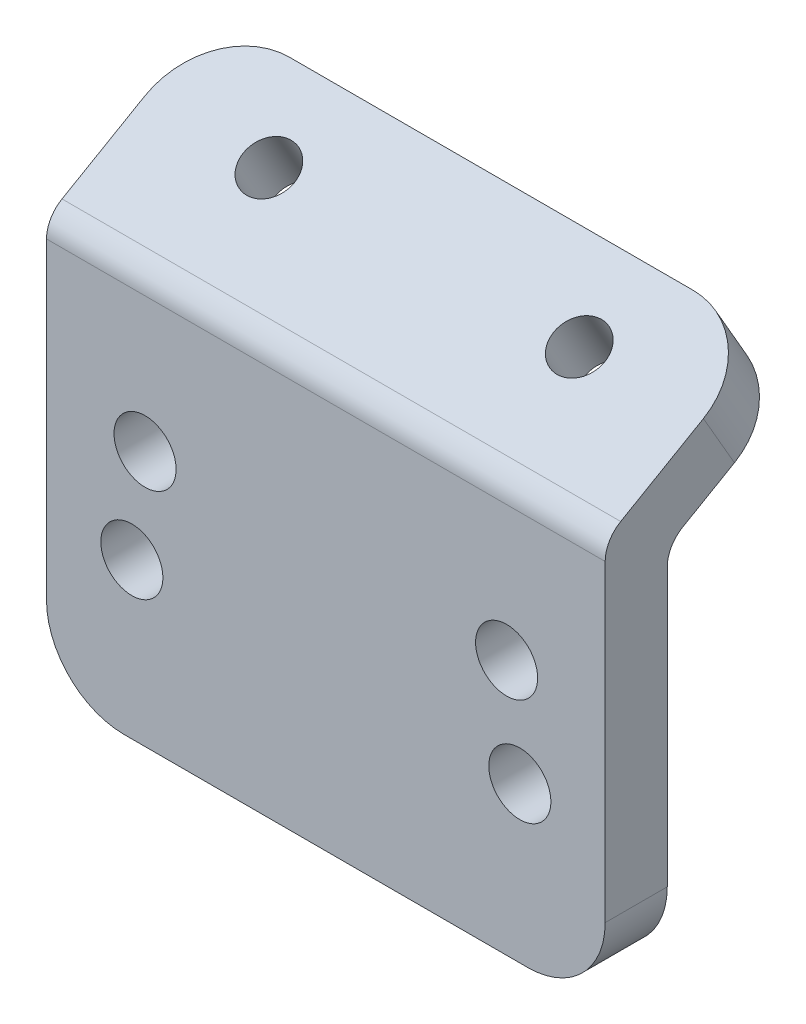
ISO-10303-21;
HEADER;
FILE_DESCRIPTION(('STEP AP214'),'2;1');
FILE_NAME('part.step','',(''),(''),'','','');
FILE_SCHEMA(('AUTOMOTIVE_DESIGN { 1 0 10303 214 1 1 1 1 }'));
ENDSEC;
DATA;
#1=APPLICATION_CONTEXT('core data for automotive mechanical design processes');
#2=APPLICATION_PROTOCOL_DEFINITION('international standard','automotive_design',2000,#1);
#3=PRODUCT_CONTEXT('',#1,'mechanical');
#4=PRODUCT('Part','Part','',(#3));
#5=PRODUCT_RELATED_PRODUCT_CATEGORY('part','',(#4));
#6=PRODUCT_DEFINITION_FORMATION('','',#4);
#7=PRODUCT_DEFINITION_CONTEXT('part definition',#1,'design');
#8=PRODUCT_DEFINITION('design','',#6,#7);
#9=PRODUCT_DEFINITION_SHAPE('','',#8);
#10=(LENGTH_UNIT() NAMED_UNIT(*) SI_UNIT(.MILLI.,.METRE.));
#11=(NAMED_UNIT(*) PLANE_ANGLE_UNIT() SI_UNIT($,.RADIAN.));
#12=(NAMED_UNIT(*) SI_UNIT($,.STERADIAN.) SOLID_ANGLE_UNIT());
#13=UNCERTAINTY_MEASURE_WITH_UNIT(LENGTH_MEASURE(1.E-05),#10,'distance_accuracy_value','');
#14=(GEOMETRIC_REPRESENTATION_CONTEXT(3) GLOBAL_UNCERTAINTY_ASSIGNED_CONTEXT((#13)) GLOBAL_UNIT_ASSIGNED_CONTEXT((#10,
#11,#12)) REPRESENTATION_CONTEXT('',''));
#15=CARTESIAN_POINT('',(0.,0.,0.));
#16=DIRECTION('',(0.,0.,1.));
#17=DIRECTION('',(1.,0.,0.));
#18=AXIS2_PLACEMENT_3D('',#15,#16,#17);
#19=CARTESIAN_POINT('',(0.,0.,4.));
#20=DIRECTION('',(1.,0.,0.));
#21=DIRECTION('',(0.,0.,-1.));
#22=AXIS2_PLACEMENT_3D('',#19,#20,#21);
#23=PLANE('',#22);
#24=DIRECTION('',(0.,-1.,0.));
#25=VECTOR('',#24,1.);
#26=CARTESIAN_POINT('',(0.,0.,4.));
#27=LINE('',#26,#25);
#28=CARTESIAN_POINT('',(0.,25.1547005383793,4.));
#29=VERTEX_POINT('',#28);
#30=CARTESIAN_POINT('',(0.,5.,4.));
#31=VERTEX_POINT('',#30);
#32=EDGE_CURVE('E250',#29,#31,#27,.T.);
#33=ORIENTED_EDGE('',*,*,#32,.F.);
#34=CARTESIAN_POINT('',(0.,25.1547005383793,2.));
#35=DIRECTION('',(1.,0.,0.));
#36=DIRECTION('',(0.,0.,-1.));
#37=AXIS2_PLACEMENT_3D('',#34,#35,#36);
#38=CIRCLE('',#37,2.);
#39=CARTESIAN_POINT('',(0.,26.8867513459481,2.99999999999999));
#40=VERTEX_POINT('',#39);
#41=EDGE_CURVE('E194',#29,#40,#38,.F.);
#42=ORIENTED_EDGE('',*,*,#41,.T.);
#43=DIRECTION('',(0.,-0.499999999999998,0.86602540378444));
#44=VECTOR('',#43,1.);
#45=CARTESIAN_POINT('',(0.,32.4641016151377,-6.66025403784441));
#46=LINE('',#45,#44);
#47=CARTESIAN_POINT('',(0.,29.9641016151378,-2.33012701892221));
#48=VERTEX_POINT('',#47);
#49=EDGE_CURVE('E148',#48,#40,#46,.T.);
#50=ORIENTED_EDGE('',*,*,#49,.F.);
#51=DIRECTION('',(0.,0.86602540378444,0.499999999999998));
#52=VECTOR('',#51,1.);
#53=CARTESIAN_POINT('',(0.,26.5,-4.3301270189222));
#54=LINE('',#53,#52);
#55=CARTESIAN_POINT('',(0.,26.5,-4.3301270189222));
#56=VERTEX_POINT('',#55);
#57=EDGE_CURVE('E163',#48,#56,#54,.F.);
#58=ORIENTED_EDGE('',*,*,#57,.T.);
#59=DIRECTION('',(0.,0.499999999999998,-0.866025403784439));
#60=VECTOR('',#59,1.);
#61=CARTESIAN_POINT('',(0.,24.,0.));
#62=LINE('',#61,#60);
#63=CARTESIAN_POINT('',(0.,24.5773502691896,-1.));
#64=VERTEX_POINT('',#63);
#65=EDGE_CURVE('E131',#64,#56,#62,.T.);
#66=ORIENTED_EDGE('',*,*,#65,.F.);
#67=CARTESIAN_POINT('',(0.,22.8452994616207,-2.));
#68=DIRECTION('',(1.,0.,0.));
#69=DIRECTION('',(0.,0.,-1.));
#70=AXIS2_PLACEMENT_3D('',#67,#68,#69);
#71=CIRCLE('',#70,2.);
#72=CARTESIAN_POINT('',(0.,22.8452994616207,0.));
#73=VERTEX_POINT('',#72);
#74=EDGE_CURVE('E41',#64,#73,#71,.T.);
#75=ORIENTED_EDGE('',*,*,#74,.T.);
#76=DIRECTION('',(0.,-1.,0.));
#77=VECTOR('',#76,1.);
#78=CARTESIAN_POINT('',(0.,0.,0.));
#79=LINE('',#78,#77);
#80=CARTESIAN_POINT('',(0.,5.,0.));
#81=VERTEX_POINT('',#80);
#82=EDGE_CURVE('E197',#73,#81,#79,.T.);
#83=ORIENTED_EDGE('',*,*,#82,.T.);
#84=DIRECTION('',(0.,0.,-1.));
#85=VECTOR('',#84,1.);
#86=CARTESIAN_POINT('',(0.,5.,4.));
#87=LINE('',#86,#85);
#88=EDGE_CURVE('E160',#81,#31,#87,.F.);
#89=ORIENTED_EDGE('',*,*,#88,.T.);
#90=EDGE_LOOP('',(#33,#42,#50,#58,#66,#75,#83,#89));
#91=FACE_BOUND('',#90,.T.);
#92=ADVANCED_FACE('F33',(#91),#23,.F.);
#93=CARTESIAN_POINT('',(0.,0.,4.));
#94=DIRECTION('',(0.,1.,0.));
#95=DIRECTION('',(0.,0.,1.));
#96=AXIS2_PLACEMENT_3D('',#93,#94,#95);
#97=PLANE('',#96);
#98=DIRECTION('',(1.,0.,0.));
#99=VECTOR('',#98,1.);
#100=CARTESIAN_POINT('',(0.,0.,4.));
#101=LINE('',#100,#99);
#102=CARTESIAN_POINT('',(5.,0.,4.));
#103=VERTEX_POINT('',#102);
#104=CARTESIAN_POINT('',(31.,0.,4.));
#105=VERTEX_POINT('',#104);
#106=EDGE_CURVE('E252',#103,#105,#101,.T.);
#107=ORIENTED_EDGE('',*,*,#106,.F.);
#108=DIRECTION('',(0.,0.,-1.));
#109=VECTOR('',#108,1.);
#110=CARTESIAN_POINT('',(5.,0.,4.));
#111=LINE('',#110,#109);
#112=CARTESIAN_POINT('',(5.,0.,0.));
#113=VERTEX_POINT('',#112);
#114=EDGE_CURVE('E173',#103,#113,#111,.T.);
#115=ORIENTED_EDGE('',*,*,#114,.T.);
#116=DIRECTION('',(1.,0.,0.));
#117=VECTOR('',#116,1.);
#118=CARTESIAN_POINT('',(0.,0.,0.));
#119=LINE('',#118,#117);
#120=CARTESIAN_POINT('',(31.,0.,0.));
#121=VERTEX_POINT('',#120);
#122=EDGE_CURVE('E207',#113,#121,#119,.T.);
#123=ORIENTED_EDGE('',*,*,#122,.T.);
#124=DIRECTION('',(0.,0.,-1.));
#125=VECTOR('',#124,1.);
#126=CARTESIAN_POINT('',(31.,0.,4.));
#127=LINE('',#126,#125);
#128=EDGE_CURVE('E171',#121,#105,#127,.F.);
#129=ORIENTED_EDGE('',*,*,#128,.T.);
#130=EDGE_LOOP('',(#107,#115,#123,#129));
#131=FACE_BOUND('',#130,.T.);
#132=ADVANCED_FACE('F284',(#131),#97,.F.);
#133=CARTESIAN_POINT('',(36.,0.,4.));
#134=DIRECTION('',(-1.,0.,0.));
#135=DIRECTION('',(0.,0.,1.));
#136=AXIS2_PLACEMENT_3D('',#133,#134,#135);
#137=PLANE('',#136);
#138=DIRECTION('',(0.,-0.499999999999998,0.86602540378444));
#139=VECTOR('',#138,1.);
#140=CARTESIAN_POINT('',(36.,32.4641016151377,-6.66025403784441));
#141=LINE('',#140,#139);
#142=CARTESIAN_POINT('',(36.,29.9641016151378,-2.33012701892221));
#143=VERTEX_POINT('',#142);
#144=CARTESIAN_POINT('',(36.,26.8867513459481,2.99999999999999));
#145=VERTEX_POINT('',#144);
#146=EDGE_CURVE('E216',#143,#145,#141,.T.);
#147=ORIENTED_EDGE('',*,*,#146,.T.);
#148=CARTESIAN_POINT('',(36.,25.1547005383793,2.));
#149=DIRECTION('',(-1.,0.,0.));
#150=DIRECTION('',(0.,0.,1.));
#151=AXIS2_PLACEMENT_3D('',#148,#149,#150);
#152=CIRCLE('',#151,2.);
#153=CARTESIAN_POINT('',(36.,25.1547005383793,4.));
#154=VERTEX_POINT('',#153);
#155=EDGE_CURVE('E56',#145,#154,#152,.F.);
#156=ORIENTED_EDGE('',*,*,#155,.T.);
#157=DIRECTION('',(0.,1.,0.));
#158=VECTOR('',#157,1.);
#159=CARTESIAN_POINT('',(36.,0.,4.));
#160=LINE('',#159,#158);
#161=CARTESIAN_POINT('',(36.,5.,4.));
#162=VERTEX_POINT('',#161);
#163=EDGE_CURVE('E155',#162,#154,#160,.T.);
#164=ORIENTED_EDGE('',*,*,#163,.F.);
#165=DIRECTION('',(0.,0.,-1.));
#166=VECTOR('',#165,1.);
#167=CARTESIAN_POINT('',(36.,5.,4.));
#168=LINE('',#167,#166);
#169=CARTESIAN_POINT('',(36.,5.,0.));
#170=VERTEX_POINT('',#169);
#171=EDGE_CURVE('E136',#162,#170,#168,.T.);
#172=ORIENTED_EDGE('',*,*,#171,.T.);
#173=DIRECTION('',(0.,1.,0.));
#174=VECTOR('',#173,1.);
#175=CARTESIAN_POINT('',(36.,0.,0.));
#176=LINE('',#175,#174);
#177=CARTESIAN_POINT('',(36.,22.8452994616207,0.));
#178=VERTEX_POINT('',#177);
#179=EDGE_CURVE('E214',#170,#178,#176,.T.);
#180=ORIENTED_EDGE('',*,*,#179,.T.);
#181=CARTESIAN_POINT('',(36.,22.8452994616207,-2.));
#182=DIRECTION('',(-1.,0.,0.));
#183=DIRECTION('',(0.,0.,1.));
#184=AXIS2_PLACEMENT_3D('',#181,#182,#183);
#185=CIRCLE('',#184,2.);
#186=CARTESIAN_POINT('',(36.,24.5773502691896,-1.));
#187=VERTEX_POINT('',#186);
#188=EDGE_CURVE('E11',#178,#187,#185,.T.);
#189=ORIENTED_EDGE('',*,*,#188,.T.);
#190=DIRECTION('',(0.,0.499999999999998,-0.866025403784439));
#191=VECTOR('',#190,1.);
#192=CARTESIAN_POINT('',(36.,24.,0.));
#193=LINE('',#192,#191);
#194=CARTESIAN_POINT('',(36.,26.5,-4.3301270189222));
#195=VERTEX_POINT('',#194);
#196=EDGE_CURVE('E213',#187,#195,#193,.T.);
#197=ORIENTED_EDGE('',*,*,#196,.T.);
#198=DIRECTION('',(0.,0.86602540378444,0.499999999999998));
#199=VECTOR('',#198,1.);
#200=CARTESIAN_POINT('',(36.,29.9641016151378,-2.3301270189222));
#201=LINE('',#200,#199);
#202=EDGE_CURVE('E168',#195,#143,#201,.T.);
#203=ORIENTED_EDGE('',*,*,#202,.T.);
#204=EDGE_LOOP('',(#147,#156,#164,#172,#180,#189,#197,#203));
#205=FACE_BOUND('',#204,.T.);
#206=ADVANCED_FACE('F212',(#205),#137,.F.);
#207=CARTESIAN_POINT('',(0.,0.,4.));
#208=DIRECTION('',(0.,0.,-1.));
#209=DIRECTION('',(-1.,0.,0.));
#210=AXIS2_PLACEMENT_3D('',#207,#208,#209);
#211=PLANE('',#210);
#212=CARTESIAN_POINT('',(30.5,10.,4.));
#213=DIRECTION('',(0.,0.,-1.));
#214=DIRECTION('',(-1.,0.,0.));
#215=AXIS2_PLACEMENT_3D('',#212,#213,#214);
#216=CIRCLE('',#215,2.);
#217=CARTESIAN_POINT('',(28.5,10.,4.));
#218=VERTEX_POINT('',#217);
#219=EDGE_CURVE('E242',#218,#218,#216,.T.);
#220=ORIENTED_EDGE('',*,*,#219,.T.);
#221=EDGE_LOOP('',(#220));
#222=FACE_BOUND('',#221,.T.);
#223=CARTESIAN_POINT('',(29.6481456572267,16.470476127563,4.));
#224=DIRECTION('',(0.,0.,-1.));
#225=DIRECTION('',(-1.,0.,0.));
#226=AXIS2_PLACEMENT_3D('',#223,#224,#225);
#227=CIRCLE('',#226,2.00000000000002);
#228=CARTESIAN_POINT('',(27.6481456572267,16.470476127563,4.));
#229=VERTEX_POINT('',#228);
#230=EDGE_CURVE('E239',#229,#229,#227,.T.);
#231=ORIENTED_EDGE('',*,*,#230,.T.);
#232=EDGE_LOOP('',(#231));
#233=FACE_BOUND('',#232,.T.);
#234=CARTESIAN_POINT('',(6.35185434277329,16.470476127563,4.));
#235=DIRECTION('',(0.,0.,-1.));
#236=DIRECTION('',(-1.,0.,0.));
#237=AXIS2_PLACEMENT_3D('',#234,#235,#236);
#238=CIRCLE('',#237,2.);
#239=CARTESIAN_POINT('',(4.35185434277329,16.470476127563,4.));
#240=VERTEX_POINT('',#239);
#241=EDGE_CURVE('E231',#240,#240,#238,.T.);
#242=ORIENTED_EDGE('',*,*,#241,.T.);
#243=EDGE_LOOP('',(#242));
#244=FACE_BOUND('',#243,.T.);
#245=CARTESIAN_POINT('',(5.5,10.,4.));
#246=DIRECTION('',(0.,0.,-1.));
#247=DIRECTION('',(-1.,0.,0.));
#248=AXIS2_PLACEMENT_3D('',#245,#246,#247);
#249=CIRCLE('',#248,2.);
#250=CARTESIAN_POINT('',(3.5,10.,4.));
#251=VERTEX_POINT('',#250);
#252=EDGE_CURVE('E208',#251,#251,#249,.T.);
#253=ORIENTED_EDGE('',*,*,#252,.T.);
#254=EDGE_LOOP('',(#253));
#255=FACE_BOUND('',#254,.T.);
#256=ORIENTED_EDGE('',*,*,#163,.T.);
#257=DIRECTION('',(1.,0.,0.));
#258=VECTOR('',#257,1.);
#259=CARTESIAN_POINT('',(0.,25.1547005383793,4.));
#260=LINE('',#259,#258);
#261=EDGE_CURVE('E48',#154,#29,#260,.F.);
#262=ORIENTED_EDGE('',*,*,#261,.T.);
#263=ORIENTED_EDGE('',*,*,#32,.T.);
#264=CARTESIAN_POINT('',(5.,5.,4.));
#265=DIRECTION('',(0.,0.,-1.));
#266=DIRECTION('',(-1.,0.,0.));
#267=AXIS2_PLACEMENT_3D('',#264,#265,#266);
#268=CIRCLE('',#267,5.);
#269=EDGE_CURVE('E183',#31,#103,#268,.F.);
#270=ORIENTED_EDGE('',*,*,#269,.T.);
#271=ORIENTED_EDGE('',*,*,#106,.T.);
#272=CARTESIAN_POINT('',(31.,5.,4.));
#273=DIRECTION('',(0.,0.,-1.));
#274=DIRECTION('',(-1.,0.,0.));
#275=AXIS2_PLACEMENT_3D('',#272,#273,#274);
#276=CIRCLE('',#275,5.);
#277=EDGE_CURVE('E181',#105,#162,#276,.F.);
#278=ORIENTED_EDGE('',*,*,#277,.T.);
#279=EDGE_LOOP('',(#256,#262,#263,#270,#271,#278));
#280=FACE_BOUND('',#279,.T.);
#281=ADVANCED_FACE('F278',(#222,#233,#244,#255,#280),#211,.F.);
#282=CARTESIAN_POINT('',(0.,0.,0.));
#283=DIRECTION('',(0.,0.,-1.));
#284=DIRECTION('',(-1.,0.,0.));
#285=AXIS2_PLACEMENT_3D('',#282,#283,#284);
#286=PLANE('',#285);
#287=CARTESIAN_POINT('',(30.5,10.,0.));
#288=DIRECTION('',(0.,0.,1.));
#289=DIRECTION('',(-1.,0.,0.));
#290=AXIS2_PLACEMENT_3D('',#287,#288,#289);
#291=CIRCLE('',#290,2.);
#292=CARTESIAN_POINT('',(28.5,10.,0.));
#293=VERTEX_POINT('',#292);
#294=EDGE_CURVE('E228',#293,#293,#291,.T.);
#295=ORIENTED_EDGE('',*,*,#294,.T.);
#296=EDGE_LOOP('',(#295));
#297=FACE_BOUND('',#296,.T.);
#298=CARTESIAN_POINT('',(29.6481456572267,16.470476127563,0.));
#299=DIRECTION('',(0.,0.,1.));
#300=DIRECTION('',(1.,0.,0.));
#301=AXIS2_PLACEMENT_3D('',#298,#299,#300);
#302=CIRCLE('',#301,2.00000000000002);
#303=CARTESIAN_POINT('',(31.6481456572267,16.470476127563,0.));
#304=VERTEX_POINT('',#303);
#305=EDGE_CURVE('E232',#304,#304,#302,.T.);
#306=ORIENTED_EDGE('',*,*,#305,.T.);
#307=EDGE_LOOP('',(#306));
#308=FACE_BOUND('',#307,.T.);
#309=CARTESIAN_POINT('',(6.35185434277329,16.470476127563,0.));
#310=DIRECTION('',(0.,0.,1.));
#311=DIRECTION('',(-1.,0.,0.));
#312=AXIS2_PLACEMENT_3D('',#309,#310,#311);
#313=CIRCLE('',#312,2.);
#314=CARTESIAN_POINT('',(4.35185434277329,16.470476127563,0.));
#315=VERTEX_POINT('',#314);
#316=EDGE_CURVE('E226',#315,#315,#313,.T.);
#317=ORIENTED_EDGE('',*,*,#316,.T.);
#318=EDGE_LOOP('',(#317));
#319=FACE_BOUND('',#318,.T.);
#320=CARTESIAN_POINT('',(5.5,10.,0.));
#321=DIRECTION('',(0.,0.,1.));
#322=DIRECTION('',(1.,0.,0.));
#323=AXIS2_PLACEMENT_3D('',#320,#321,#322);
#324=CIRCLE('',#323,2.);
#325=CARTESIAN_POINT('',(7.5,10.,0.));
#326=VERTEX_POINT('',#325);
#327=EDGE_CURVE('E245',#326,#326,#324,.T.);
#328=ORIENTED_EDGE('',*,*,#327,.T.);
#329=EDGE_LOOP('',(#328));
#330=FACE_BOUND('',#329,.T.);
#331=ORIENTED_EDGE('',*,*,#82,.F.);
#332=DIRECTION('',(-1.,0.,0.));
#333=VECTOR('',#332,1.);
#334=CARTESIAN_POINT('',(36.,22.8452994616207,0.));
#335=LINE('',#334,#333);
#336=EDGE_CURVE('E187',#73,#178,#335,.F.);
#337=ORIENTED_EDGE('',*,*,#336,.T.);
#338=ORIENTED_EDGE('',*,*,#179,.F.);
#339=CARTESIAN_POINT('',(31.,5.,0.));
#340=DIRECTION('',(0.,0.,-1.));
#341=DIRECTION('',(-1.,0.,0.));
#342=AXIS2_PLACEMENT_3D('',#339,#340,#341);
#343=CIRCLE('',#342,5.);
#344=EDGE_CURVE('E176',#170,#121,#343,.T.);
#345=ORIENTED_EDGE('',*,*,#344,.T.);
#346=ORIENTED_EDGE('',*,*,#122,.F.);
#347=CARTESIAN_POINT('',(5.,5.,0.));
#348=DIRECTION('',(0.,0.,-1.));
#349=DIRECTION('',(-1.,0.,0.));
#350=AXIS2_PLACEMENT_3D('',#347,#348,#349);
#351=CIRCLE('',#350,5.);
#352=EDGE_CURVE('E178',#113,#81,#351,.T.);
#353=ORIENTED_EDGE('',*,*,#352,.T.);
#354=EDGE_LOOP('',(#331,#337,#338,#345,#346,#353));
#355=FACE_BOUND('',#354,.T.);
#356=ADVANCED_FACE('F202',(#297,#308,#319,#330,#355),#286,.T.);
#357=CARTESIAN_POINT('',(5.5,10.,0.));
#358=DIRECTION('',(0.,0.,1.));
#359=DIRECTION('',(1.,0.,0.));
#360=AXIS2_PLACEMENT_3D('',#357,#358,#359);
#361=CYLINDRICAL_SURFACE('',#360,2.);
#362=ORIENTED_EDGE('',*,*,#327,.F.);
#363=EDGE_LOOP('',(#362));
#364=FACE_BOUND('',#363,.T.);
#365=ORIENTED_EDGE('',*,*,#252,.F.);
#366=EDGE_LOOP('',(#365));
#367=FACE_BOUND('',#366,.T.);
#368=ADVANCED_FACE('F339',(#364,#367),#361,.F.);
#369=CARTESIAN_POINT('',(6.35185434277329,16.470476127563,0.));
#370=DIRECTION('',(0.,0.,1.));
#371=DIRECTION('',(1.,0.,0.));
#372=AXIS2_PLACEMENT_3D('',#369,#370,#371);
#373=CYLINDRICAL_SURFACE('',#372,2.);
#374=ORIENTED_EDGE('',*,*,#316,.F.);
#375=EDGE_LOOP('',(#374));
#376=FACE_BOUND('',#375,.T.);
#377=ORIENTED_EDGE('',*,*,#241,.F.);
#378=EDGE_LOOP('',(#377));
#379=FACE_BOUND('',#378,.T.);
#380=ADVANCED_FACE('F335',(#376,#379),#373,.F.);
#381=CARTESIAN_POINT('',(29.6481456572267,16.470476127563,0.));
#382=DIRECTION('',(0.,0.,1.));
#383=DIRECTION('',(1.,0.,0.));
#384=AXIS2_PLACEMENT_3D('',#381,#382,#383);
#385=CYLINDRICAL_SURFACE('',#384,2.00000000000002);
#386=ORIENTED_EDGE('',*,*,#305,.F.);
#387=EDGE_LOOP('',(#386));
#388=FACE_BOUND('',#387,.T.);
#389=ORIENTED_EDGE('',*,*,#230,.F.);
#390=EDGE_LOOP('',(#389));
#391=FACE_BOUND('',#390,.T.);
#392=ADVANCED_FACE('F331',(#388,#391),#385,.F.);
#393=CARTESIAN_POINT('',(30.5,10.,0.));
#394=DIRECTION('',(0.,0.,1.));
#395=DIRECTION('',(1.,0.,0.));
#396=AXIS2_PLACEMENT_3D('',#393,#394,#395);
#397=CYLINDRICAL_SURFACE('',#396,2.);
#398=ORIENTED_EDGE('',*,*,#294,.F.);
#399=EDGE_LOOP('',(#398));
#400=FACE_BOUND('',#399,.T.);
#401=ORIENTED_EDGE('',*,*,#219,.F.);
#402=EDGE_LOOP('',(#401));
#403=FACE_BOUND('',#402,.T.);
#404=ADVANCED_FACE('F322',(#400,#403),#397,.F.);
#405=CARTESIAN_POINT('',(0.,32.4641016151377,-6.66025403784441));
#406=DIRECTION('',(0.,0.86602540378444,0.499999999999998));
#407=DIRECTION('',(0.,-0.499999999999998,0.86602540378444));
#408=AXIS2_PLACEMENT_3D('',#405,#406,#407);
#409=PLANE('',#408);
#410=CARTESIAN_POINT('',(28.,29.9641016151377,-2.3301270189222));
#411=DIRECTION('',(0.,0.86602540378444,0.499999999999998));
#412=DIRECTION('',(0.,-0.499999999999998,0.86602540378444));
#413=AXIS2_PLACEMENT_3D('',#410,#411,#412);
#414=CIRCLE('',#413,1.65);
#415=CARTESIAN_POINT('',(28.,29.1391016151377,-0.901185102677871));
#416=VERTEX_POINT('',#415);
#417=EDGE_CURVE('E260',#416,#416,#414,.T.);
#418=ORIENTED_EDGE('',*,*,#417,.F.);
#419=EDGE_LOOP('',(#418));
#420=FACE_BOUND('',#419,.T.);
#421=CARTESIAN_POINT('',(8.,29.9641016151377,-2.3301270189222));
#422=DIRECTION('',(0.,0.86602540378444,0.499999999999998));
#423=DIRECTION('',(0.,-0.499999999999998,0.86602540378444));
#424=AXIS2_PLACEMENT_3D('',#421,#422,#423);
#425=CIRCLE('',#424,1.65);
#426=CARTESIAN_POINT('',(8.,29.1391016151378,-0.901185102677873));
#427=VERTEX_POINT('',#426);
#428=EDGE_CURVE('E217',#427,#427,#425,.T.);
#429=ORIENTED_EDGE('',*,*,#428,.F.);
#430=EDGE_LOOP('',(#429));
#431=FACE_BOUND('',#430,.T.);
#432=ORIENTED_EDGE('',*,*,#49,.T.);
#433=DIRECTION('',(1.,0.,0.));
#434=VECTOR('',#433,1.);
#435=CARTESIAN_POINT('',(36.,26.8867513459481,3.));
#436=LINE('',#435,#434);
#437=EDGE_CURVE('E189',#40,#145,#436,.T.);
#438=ORIENTED_EDGE('',*,*,#437,.T.);
#439=ORIENTED_EDGE('',*,*,#146,.F.);
#440=CARTESIAN_POINT('',(31.,29.9641016151377,-2.33012701892221));
#441=DIRECTION('',(0.,0.86602540378444,0.499999999999998));
#442=DIRECTION('',(0.,-0.499999999999998,0.86602540378444));
#443=AXIS2_PLACEMENT_3D('',#440,#441,#442);
#444=CIRCLE('',#443,5.);
#445=CARTESIAN_POINT('',(31.,32.4641016151377,-6.66025403784441));
#446=VERTEX_POINT('',#445);
#447=EDGE_CURVE('E152',#143,#446,#444,.T.);
#448=ORIENTED_EDGE('',*,*,#447,.T.);
#449=DIRECTION('',(1.,0.,0.));
#450=VECTOR('',#449,1.);
#451=CARTESIAN_POINT('',(0.,32.4641016151377,-6.66025403784441));
#452=LINE('',#451,#450);
#453=CARTESIAN_POINT('',(5.,32.4641016151377,-6.66025403784441));
#454=VERTEX_POINT('',#453);
#455=EDGE_CURVE('E147',#454,#446,#452,.T.);
#456=ORIENTED_EDGE('',*,*,#455,.F.);
#457=CARTESIAN_POINT('',(5.,29.9641016151378,-2.33012701892221));
#458=DIRECTION('',(0.,0.86602540378444,0.499999999999998));
#459=DIRECTION('',(0.,-0.499999999999998,0.86602540378444));
#460=AXIS2_PLACEMENT_3D('',#457,#458,#459);
#461=CIRCLE('',#460,5.);
#462=EDGE_CURVE('E151',#454,#48,#461,.T.);
#463=ORIENTED_EDGE('',*,*,#462,.T.);
#464=EDGE_LOOP('',(#432,#438,#439,#448,#456,#463));
#465=FACE_BOUND('',#464,.T.);
#466=ADVANCED_FACE('F273',(#420,#431,#465),#409,.T.);
#467=CARTESIAN_POINT('',(0.,29.,-8.66025403784439));
#468=DIRECTION('',(0.,0.499999999999998,-0.86602540378444));
#469=DIRECTION('',(0.,0.86602540378444,0.499999999999998));
#470=AXIS2_PLACEMENT_3D('',#467,#468,#469);
#471=PLANE('',#470);
#472=DIRECTION('',(1.,0.,0.));
#473=VECTOR('',#472,1.);
#474=CARTESIAN_POINT('',(0.,29.,-8.66025403784439));
#475=LINE('',#474,#473);
#476=CARTESIAN_POINT('',(5.,29.,-8.66025403784439));
#477=VERTEX_POINT('',#476);
#478=CARTESIAN_POINT('',(31.,29.,-8.66025403784439));
#479=VERTEX_POINT('',#478);
#480=EDGE_CURVE('E127',#477,#479,#475,.T.);
#481=ORIENTED_EDGE('',*,*,#480,.F.);
#482=DIRECTION('',(0.,0.86602540378444,0.499999999999998));
#483=VECTOR('',#482,1.);
#484=CARTESIAN_POINT('',(5.,32.4641016151377,-6.6602540378444));
#485=LINE('',#484,#483);
#486=EDGE_CURVE('E143',#477,#454,#485,.T.);
#487=ORIENTED_EDGE('',*,*,#486,.T.);
#488=ORIENTED_EDGE('',*,*,#455,.T.);
#489=DIRECTION('',(0.,0.86602540378444,0.499999999999998));
#490=VECTOR('',#489,1.);
#491=CARTESIAN_POINT('',(31.,29.,-8.66025403784439));
#492=LINE('',#491,#490);
#493=EDGE_CURVE('E146',#446,#479,#492,.F.);
#494=ORIENTED_EDGE('',*,*,#493,.T.);
#495=EDGE_LOOP('',(#481,#487,#488,#494));
#496=FACE_BOUND('',#495,.T.);
#497=ADVANCED_FACE('F141',(#496),#471,.T.);
#498=CARTESIAN_POINT('',(0.,24.,0.));
#499=DIRECTION('',(0.,-0.866025403784439,-0.499999999999998));
#500=DIRECTION('',(0.,0.499999999999998,-0.86602540378444));
#501=AXIS2_PLACEMENT_3D('',#498,#499,#500);
#502=PLANE('',#501);
#503=CARTESIAN_POINT('',(28.,26.5,-4.33012701892219));
#504=DIRECTION('',(0.,-0.866025403784439,-0.499999999999998));
#505=DIRECTION('',(0.,0.499999999999998,-0.86602540378444));
#506=AXIS2_PLACEMENT_3D('',#503,#504,#505);
#507=CIRCLE('',#506,1.65);
#508=CARTESIAN_POINT('',(28.,27.325,-5.75906893516652));
#509=VERTEX_POINT('',#508);
#510=EDGE_CURVE('E261',#509,#509,#507,.T.);
#511=ORIENTED_EDGE('',*,*,#510,.F.);
#512=EDGE_LOOP('',(#511));
#513=FACE_BOUND('',#512,.T.);
#514=CARTESIAN_POINT('',(8.,26.5,-4.33012701892219));
#515=DIRECTION('',(0.,-0.866025403784439,-0.499999999999998));
#516=DIRECTION('',(0.,0.499999999999998,-0.86602540378444));
#517=AXIS2_PLACEMENT_3D('',#514,#515,#516);
#518=CIRCLE('',#517,1.65);
#519=CARTESIAN_POINT('',(8.,27.325,-5.75906893516651));
#520=VERTEX_POINT('',#519);
#521=EDGE_CURVE('E221',#520,#520,#518,.T.);
#522=ORIENTED_EDGE('',*,*,#521,.F.);
#523=EDGE_LOOP('',(#522));
#524=FACE_BOUND('',#523,.T.);
#525=ORIENTED_EDGE('',*,*,#196,.F.);
#526=DIRECTION('',(-1.,0.,0.));
#527=VECTOR('',#526,1.);
#528=CARTESIAN_POINT('',(0.,24.5773502691896,-1.));
#529=LINE('',#528,#527);
#530=EDGE_CURVE('E185',#187,#64,#529,.T.);
#531=ORIENTED_EDGE('',*,*,#530,.T.);
#532=ORIENTED_EDGE('',*,*,#65,.T.);
#533=CARTESIAN_POINT('',(5.,26.5,-4.3301270189222));
#534=DIRECTION('',(0.,-0.866025403784439,-0.499999999999998));
#535=DIRECTION('',(0.,0.499999999999998,-0.86602540378444));
#536=AXIS2_PLACEMENT_3D('',#533,#534,#535);
#537=CIRCLE('',#536,5.);
#538=EDGE_CURVE('E122',#56,#477,#537,.T.);
#539=ORIENTED_EDGE('',*,*,#538,.T.);
#540=ORIENTED_EDGE('',*,*,#480,.T.);
#541=CARTESIAN_POINT('',(31.,26.5,-4.3301270189222));
#542=DIRECTION('',(0.,-0.866025403784439,-0.499999999999998));
#543=DIRECTION('',(0.,0.499999999999998,-0.86602540378444));
#544=AXIS2_PLACEMENT_3D('',#541,#542,#543);
#545=CIRCLE('',#544,5.);
#546=EDGE_CURVE('E137',#479,#195,#545,.T.);
#547=ORIENTED_EDGE('',*,*,#546,.T.);
#548=EDGE_LOOP('',(#525,#531,#532,#539,#540,#547));
#549=FACE_BOUND('',#548,.T.);
#550=ADVANCED_FACE('F125',(#513,#524,#549),#502,.T.);
#551=CARTESIAN_POINT('',(8.,34.5801270189222,0.33493649053888));
#552=DIRECTION('',(0.,-0.86602540378444,-0.499999999999998));
#553=DIRECTION('',(0.,0.499999999999998,-0.86602540378444));
#554=AXIS2_PLACEMENT_3D('',#551,#552,#553);
#555=CYLINDRICAL_SURFACE('',#554,1.65);
#556=ORIENTED_EDGE('',*,*,#428,.T.);
#557=EDGE_LOOP('',(#556));
#558=FACE_BOUND('',#557,.T.);
#559=ORIENTED_EDGE('',*,*,#521,.T.);
#560=EDGE_LOOP('',(#559));
#561=FACE_BOUND('',#560,.T.);
#562=ADVANCED_FACE('F312',(#558,#561),#555,.F.);
#563=CARTESIAN_POINT('',(28.,34.5801270189222,0.33493649053888));
#564=DIRECTION('',(0.,-0.86602540378444,-0.499999999999998));
#565=DIRECTION('',(0.,0.499999999999998,-0.86602540378444));
#566=AXIS2_PLACEMENT_3D('',#563,#564,#565);
#567=CYLINDRICAL_SURFACE('',#566,1.65);
#568=ORIENTED_EDGE('',*,*,#417,.T.);
#569=EDGE_LOOP('',(#568));
#570=FACE_BOUND('',#569,.T.);
#571=ORIENTED_EDGE('',*,*,#510,.T.);
#572=EDGE_LOOP('',(#571));
#573=FACE_BOUND('',#572,.T.);
#574=ADVANCED_FACE('F308',(#570,#573),#567,.F.);
#575=CARTESIAN_POINT('',(5.,26.5,-4.3301270189222));
#576=DIRECTION('',(0.,-0.86602540378444,-0.499999999999998));
#577=DIRECTION('',(0.,0.499999999999998,-0.86602540378444));
#578=AXIS2_PLACEMENT_3D('',#575,#576,#577);
#579=CYLINDRICAL_SURFACE('',#578,5.);
#580=ORIENTED_EDGE('',*,*,#538,.F.);
#581=ORIENTED_EDGE('',*,*,#57,.F.);
#582=ORIENTED_EDGE('',*,*,#462,.F.);
#583=ORIENTED_EDGE('',*,*,#486,.F.);
#584=EDGE_LOOP('',(#580,#581,#582,#583));
#585=FACE_BOUND('',#584,.T.);
#586=ADVANCED_FACE('F150',(#585),#579,.T.);
#587=CARTESIAN_POINT('',(31.,10.2320508075688,-13.7224318643354));
#588=DIRECTION('',(0.,-0.86602540378444,-0.499999999999998));
#589=DIRECTION('',(0.,0.499999999999998,-0.86602540378444));
#590=AXIS2_PLACEMENT_3D('',#587,#588,#589);
#591=CYLINDRICAL_SURFACE('',#590,5.);
#592=ORIENTED_EDGE('',*,*,#546,.F.);
#593=ORIENTED_EDGE('',*,*,#493,.F.);
#594=ORIENTED_EDGE('',*,*,#447,.F.);
#595=ORIENTED_EDGE('',*,*,#202,.F.);
#596=EDGE_LOOP('',(#592,#593,#594,#595));
#597=FACE_BOUND('',#596,.T.);
#598=ADVANCED_FACE('F289',(#597),#591,.T.);
#599=CARTESIAN_POINT('',(5.,5.,4.));
#600=DIRECTION('',(0.,0.,-1.));
#601=DIRECTION('',(-1.,0.,0.));
#602=AXIS2_PLACEMENT_3D('',#599,#600,#601);
#603=CYLINDRICAL_SURFACE('',#602,5.);
#604=ORIENTED_EDGE('',*,*,#269,.F.);
#605=ORIENTED_EDGE('',*,*,#88,.F.);
#606=ORIENTED_EDGE('',*,*,#352,.F.);
#607=ORIENTED_EDGE('',*,*,#114,.F.);
#608=EDGE_LOOP('',(#604,#605,#606,#607));
#609=FACE_BOUND('',#608,.T.);
#610=ADVANCED_FACE('F286',(#609),#603,.T.);
#611=CARTESIAN_POINT('',(31.,5.,4.));
#612=DIRECTION('',(0.,0.,-1.));
#613=DIRECTION('',(-1.,0.,0.));
#614=AXIS2_PLACEMENT_3D('',#611,#612,#613);
#615=CYLINDRICAL_SURFACE('',#614,5.);
#616=ORIENTED_EDGE('',*,*,#277,.F.);
#617=ORIENTED_EDGE('',*,*,#128,.F.);
#618=ORIENTED_EDGE('',*,*,#344,.F.);
#619=ORIENTED_EDGE('',*,*,#171,.F.);
#620=EDGE_LOOP('',(#616,#617,#618,#619));
#621=FACE_BOUND('',#620,.T.);
#622=ADVANCED_FACE('F288',(#621),#615,.T.);
#623=CARTESIAN_POINT('',(0.,22.8452994616207,-2.));
#624=DIRECTION('',(1.,0.,0.));
#625=DIRECTION('',(0.,0.,-1.));
#626=AXIS2_PLACEMENT_3D('',#623,#624,#625);
#627=CYLINDRICAL_SURFACE('',#626,2.);
#628=ORIENTED_EDGE('',*,*,#188,.F.);
#629=ORIENTED_EDGE('',*,*,#336,.F.);
#630=ORIENTED_EDGE('',*,*,#74,.F.);
#631=ORIENTED_EDGE('',*,*,#530,.F.);
#632=EDGE_LOOP('',(#628,#629,#630,#631));
#633=FACE_BOUND('',#632,.T.);
#634=ADVANCED_FACE('F211',(#633),#627,.F.);
#635=CARTESIAN_POINT('',(0.,25.1547005383793,2.));
#636=DIRECTION('',(-1.,0.,0.));
#637=DIRECTION('',(0.,0.,1.));
#638=AXIS2_PLACEMENT_3D('',#635,#636,#637);
#639=CYLINDRICAL_SURFACE('',#638,2.);
#640=ORIENTED_EDGE('',*,*,#41,.F.);
#641=ORIENTED_EDGE('',*,*,#261,.F.);
#642=ORIENTED_EDGE('',*,*,#155,.F.);
#643=ORIENTED_EDGE('',*,*,#437,.F.);
#644=EDGE_LOOP('',(#640,#641,#642,#643));
#645=FACE_BOUND('',#644,.T.);
#646=ADVANCED_FACE('F35',(#645),#639,.T.);
#647=CLOSED_SHELL('',(#92,#132,#206,#281,#356,#368,#380,#392,#404,#466,#497,#550,#562,#574,#586,
#598,#610,#622,#634,#646));
#648=MANIFOLD_SOLID_BREP('B2',#647);
#649=ADVANCED_BREP_SHAPE_REPRESENTATION('',(#18,#648),#14);
#650=SHAPE_DEFINITION_REPRESENTATION(#9,#649);
ENDSEC;
END-ISO-10303-21;
